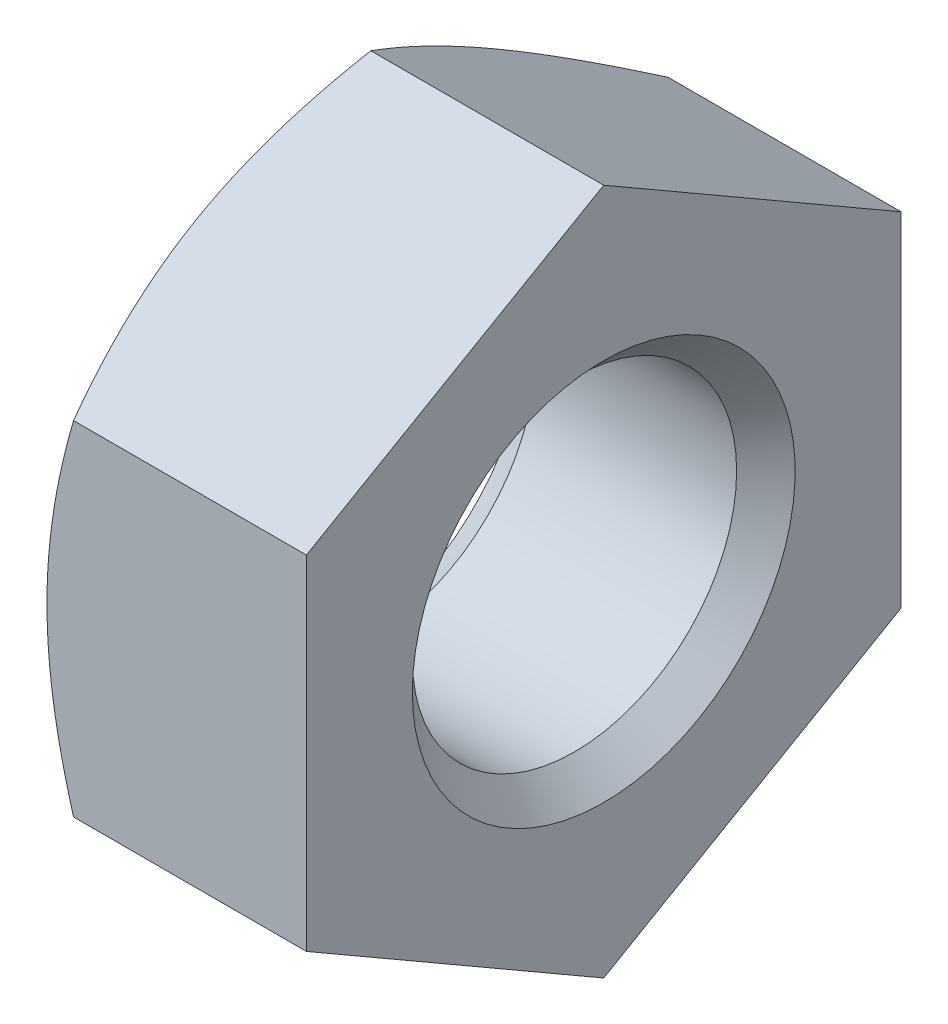
ISO-10303-21;
HEADER;
FILE_DESCRIPTION(('STEP AP214'),'2;1');
FILE_NAME('part.step','',(''),(''),'','','');
FILE_SCHEMA(('AUTOMOTIVE_DESIGN { 1 0 10303 214 1 1 1 1 }'));
ENDSEC;
DATA;
#1=APPLICATION_CONTEXT('core data for automotive mechanical design processes');
#2=APPLICATION_PROTOCOL_DEFINITION('international standard','automotive_design',2000,#1);
#3=PRODUCT_CONTEXT('',#1,'mechanical');
#4=PRODUCT('Part','Part','',(#3));
#5=PRODUCT_RELATED_PRODUCT_CATEGORY('part','',(#4));
#6=PRODUCT_DEFINITION_FORMATION('','',#4);
#7=PRODUCT_DEFINITION_CONTEXT('part definition',#1,'design');
#8=PRODUCT_DEFINITION('design','',#6,#7);
#9=PRODUCT_DEFINITION_SHAPE('','',#8);
#10=(LENGTH_UNIT() NAMED_UNIT(*) SI_UNIT(.MILLI.,.METRE.));
#11=(NAMED_UNIT(*) PLANE_ANGLE_UNIT() SI_UNIT($,.RADIAN.));
#12=(NAMED_UNIT(*) SI_UNIT($,.STERADIAN.) SOLID_ANGLE_UNIT());
#13=UNCERTAINTY_MEASURE_WITH_UNIT(LENGTH_MEASURE(1.E-05),#10,'distance_accuracy_value','');
#14=(GEOMETRIC_REPRESENTATION_CONTEXT(3) GLOBAL_UNCERTAINTY_ASSIGNED_CONTEXT((#13)) GLOBAL_UNIT_ASSIGNED_CONTEXT((#10,
#11,#12)) REPRESENTATION_CONTEXT('',''));
#15=CARTESIAN_POINT('',(0.,0.,0.));
#16=DIRECTION('',(0.,0.,1.));
#17=DIRECTION('',(1.,0.,0.));
#18=AXIS2_PLACEMENT_3D('',#15,#16,#17);
#19=CARTESIAN_POINT('',(-0.94019237886467,0.,0.));
#20=DIRECTION('',(1.,0.,0.));
#21=DIRECTION('',(0.,0.,-1.));
#22=AXIS2_PLACEMENT_3D('',#19,#20,#21);
#23=CONICAL_SURFACE('',#22,3.2,1.0471975511966);
#24=CARTESIAN_POINT('',(0.116899901263427,-4.2128176445144,-2.75));
#25=CARTESIAN_POINT('',(0.0585358150897928,-4.09206175441161,-2.75));
#26=CARTESIAN_POINT('',(0.000751313320708632,-3.97102058026674,-2.75));
#27=CARTESIAN_POINT('',(-0.11332737259427,-3.72821342104705,-2.75));
#28=CARTESIAN_POINT('',(-0.1696212991709,-3.60644731510048,-2.75));
#29=CARTESIAN_POINT('',(-0.280683816081055,-3.3613792497904,-2.75));
#30=CARTESIAN_POINT('',(-0.335441852528569,-3.23807249019038,-2.75));
#31=CARTESIAN_POINT('',(-0.442608769416106,-2.99044622504905,-2.75));
#32=CARTESIAN_POINT('',(-0.495017772139855,-2.86612677262461,-2.75));
#33=CARTESIAN_POINT('',(-0.597488011111556,-2.61472491435786,-2.75));
#34=CARTESIAN_POINT('',(-0.647512255717007,-2.48762734782283,-2.75));
#35=CARTESIAN_POINT('',(-0.743647769013464,-2.23193378863614,-2.75));
#36=CARTESIAN_POINT('',(-0.789758602600039,-2.10333763116981,-2.75));
#37=CARTESIAN_POINT('',(-0.876829746324347,-1.84470576670706,-2.75));
#38=CARTESIAN_POINT('',(-0.917800989357833,-1.71467377834625,-2.75));
#39=CARTESIAN_POINT('',(-0.993263613623143,-1.45276113270948,-2.75));
#40=CARTESIAN_POINT('',(-1.02775704200768,-1.32088107367671,-2.75));
#41=CARTESIAN_POINT('',(-1.08859053449044,-1.05518302145176,-2.75));
#42=CARTESIAN_POINT('',(-1.11492853241768,-0.921364546137669,-2.75));
#43=CARTESIAN_POINT('',(-1.15767953373874,-0.652112000043998,-2.75));
#44=CARTESIAN_POINT('',(-1.17409253050993,-0.51667792818645,-2.75));
#45=CARTESIAN_POINT('',(-1.19554160564382,-0.245762022708423,-2.75));
#46=CARTESIAN_POINT('',(-1.20064991451961,-0.110286056590175,-2.75));
#47=CARTESIAN_POINT('',(-1.1992173554919,0.160574270135581,-2.75));
#48=CARTESIAN_POINT('',(-1.19267952164877,0.295958645412523,-2.75));
#49=CARTESIAN_POINT('',(-1.17203672480029,0.527085181886233,-2.75));
#50=CARTESIAN_POINT('',(-1.16063339729711,0.623082191033736,-2.75));
#51=CARTESIAN_POINT('',(-1.13271188305182,0.81433598480462,-2.75));
#52=CARTESIAN_POINT('',(-1.1161928913043,0.909592650506843,-2.75));
#53=CARTESIAN_POINT('',(-1.059829209834,1.19417377130812,-2.75));
#54=CARTESIAN_POINT('',(-1.01319228175914,1.38216583216315,-2.75));
#55=CARTESIAN_POINT('',(-0.932739470552959,1.66347118298159,-2.75));
#56=CARTESIAN_POINT('',(-0.903761500041856,1.75825036010036,-2.75));
#57=CARTESIAN_POINT('',(-0.842933996229099,1.94681952572579,-2.75));
#58=CARTESIAN_POINT('',(-0.811086441961629,2.04061014688645,-2.75));
#59=CARTESIAN_POINT('',(-0.745182794916507,2.22681002484737,-2.75));
#60=CARTESIAN_POINT('',(-0.711140134891271,2.31922408448834,-2.75));
#61=CARTESIAN_POINT('',(-0.641053990054168,2.50333483778029,-2.75));
#62=CARTESIAN_POINT('',(-0.605009698237786,2.59503122483461,-2.75));
#63=CARTESIAN_POINT('',(-0.568162024521032,2.68639587514905,-2.75));
#64=B_SPLINE_CURVE_WITH_KNOTS('',3,(#24,#25,#26,#27,#28,#29,#30,#31,#32,#33,#34,#35,#36,#37,#38,
#39,#40,#41,#42,#43,#44,#45,#46,#47,#48,#49,#50,#51,#52,#53,#54,#55,#56,#57,#58,#59,#60,#61,#62,
#63),.UNSPECIFIED.,.F.,.F.,(4,2,2,2,2,2,2,2,2,2,2,2,2,2,2,2,2,2,2,4),(0.,0.402367371635709,
0.804803823938379,1.20953982216093,1.61425472649942,2.02396821262994,2.43372719238479,
2.8425991975322,3.2513417705758,3.6601878136146,4.06903412946197,4.47526051498547,
4.88138108563411,5.171255359401,5.46117527123616,6.0414458844777,6.33875257758383,
6.63585577731931,6.9312875346499,7.22683927936249),.UNSPECIFIED.);
#65=CARTESIAN_POINT('',(-1.2,0.,-2.75));
#66=VERTEX_POINT('',#65);
#67=CARTESIAN_POINT('',(-0.95437990693813,-1.5877132402715,-2.75));
#68=VERTEX_POINT('',#67);
#69=EDGE_CURVE('E208',#66,#68,#64,.F.);
#70=ORIENTED_EDGE('',*,*,#69,.T.);
#71=CARTESIAN_POINT('',(-0.954313236635232,-1.58759777021766,-2.7502));
#72=CARTESIAN_POINT('',(-0.99461233775073,-1.65737010029701,-2.62935077934009));
#73=CARTESIAN_POINT('',(-1.03126309740233,-1.72774469983536,-2.50745839737736));
#74=CARTESIAN_POINT('',(-1.0952378170302,-1.86971254687005,-2.2615628732721));
#75=CARTESIAN_POINT('',(-1.1225391443255,-1.94130831721585,-2.13755536142614));
#76=CARTESIAN_POINT('',(-1.16503825470588,-2.083612548896,-1.89107720202404));
#77=CARTESIAN_POINT('',(-1.18051888137754,-2.15429911309865,-1.76864448141257));
#78=CARTESIAN_POINT('',(-1.19900060263006,-2.29600490065924,-1.52320285763107));
#79=CARTESIAN_POINT('',(-1.2020170005374,-2.36702360884404,-1.40019484676707));
#80=CARTESIAN_POINT('',(-1.19574685457146,-2.49972966594897,-1.17034121338919));
#81=CARTESIAN_POINT('',(-1.1879998457233,-2.56143686540072,-1.06346120874596));
#82=CARTESIAN_POINT('',(-1.16344481893565,-2.68444923614045,-0.850397532665236));
#83=CARTESIAN_POINT('',(-1.14662841034944,-2.74575398185006,-0.744214598351098));
#84=CARTESIAN_POINT('',(-1.10458807765406,-2.86902004703204,-0.530711510606808));
#85=CARTESIAN_POINT('',(-1.07918591931279,-2.93096576264316,-0.423418383857138));
#86=CARTESIAN_POINT('',(-1.02153277416004,-3.0539332080613,-0.210432520715946));
#87=CARTESIAN_POINT('',(-0.98929533670104,-3.11495651365991,-0.104737054973346));
#88=CARTESIAN_POINT('',(-0.954313236635265,-3.17554195059674,0.000199999999999926));
#89=B_SPLINE_CURVE_WITH_KNOTS('',3,(#71,#72,#73,#74,#75,#76,#77,#78,#79,#80,#81,#82,#83,#84,#85,
#86,#87,#88),.UNSPECIFIED.,.F.,.F.,(4,2,2,2,2,2,2,2,4),(0.,0.43591282872589,0.872873557116336,
1.29901931904672,1.72464171213574,2.09526089052937,2.46622354066373,2.84541551798555,
3.22386274754521),.UNSPECIFIED.);
#90=CARTESIAN_POINT('',(-1.2,-2.38156986040723,-1.37499999999995));
#91=VERTEX_POINT('',#90);
#92=EDGE_CURVE('E11',#68,#91,#89,.T.);
#93=ORIENTED_EDGE('',*,*,#92,.T.);
#94=CARTESIAN_POINT('',(-1.2,0.,0.));
#95=DIRECTION('',(-1.,0.,0.));
#96=DIRECTION('',(0.,0.,1.));
#97=AXIS2_PLACEMENT_3D('',#94,#95,#96);
#98=CIRCLE('',#97,2.75);
#99=EDGE_CURVE('E254',#66,#91,#98,.T.);
#100=ORIENTED_EDGE('',*,*,#99,.F.);
#101=EDGE_LOOP('',(#70,#93,#100));
#102=FACE_BOUND('',#101,.T.);
#103=ADVANCED_FACE('F35',(#102),#23,.T.);
#104=CARTESIAN_POINT('',(-1.2,-2.38156986040723,1.37499999999995));
#105=VERTEX_POINT('',#104);
#106=EDGE_CURVE('E260',#91,#105,#98,.T.);
#107=ORIENTED_EDGE('',*,*,#106,.F.);
#108=CARTESIAN_POINT('',(-0.954379906938163,-3.1754264805429,0.));
#109=VERTEX_POINT('',#108);
#110=EDGE_CURVE('E39',#91,#109,#89,.T.);
#111=ORIENTED_EDGE('',*,*,#110,.T.);
#112=CARTESIAN_POINT('',(-0.954313236635265,-3.17554195059674,-0.00019999999999989));
#113=CARTESIAN_POINT('',(-0.99461233775076,-3.10576962051739,0.120649220659906));
#114=CARTESIAN_POINT('',(-1.03126309740236,-3.03539502097904,0.242541602622634));
#115=CARTESIAN_POINT('',(-1.09523781703022,-2.89342717394436,0.488437126727893));
#116=CARTESIAN_POINT('',(-1.12253914432552,-2.82183140359856,0.612444638573856));
#117=CARTESIAN_POINT('',(-1.16503825470589,-2.6795271719184,0.858922797975944));
#118=CARTESIAN_POINT('',(-1.18051888137755,-2.60884060771575,0.981355518587418));
#119=CARTESIAN_POINT('',(-1.19900060263007,-2.46713482015518,1.22679714236892));
#120=CARTESIAN_POINT('',(-1.2020170005374,-2.39611611197037,1.34980515323291));
#121=CARTESIAN_POINT('',(-1.19574685457145,-2.26341005486544,1.57965878661079));
#122=CARTESIAN_POINT('',(-1.1879998457233,-2.20170285541369,1.68653879125402));
#123=CARTESIAN_POINT('',(-1.16344481893564,-2.07869048467395,1.89960246733475));
#124=CARTESIAN_POINT('',(-1.14662841034943,-2.01738573896434,2.00578540164889));
#125=CARTESIAN_POINT('',(-1.10458807765404,-1.89411967378236,2.21928848939318));
#126=CARTESIAN_POINT('',(-1.07918591931276,-1.83217395817125,2.32658161614285));
#127=CARTESIAN_POINT('',(-1.02153277416001,-1.7092065127531,2.53956747928405));
#128=CARTESIAN_POINT('',(-0.98929533670101,-1.64818320715449,2.64526294502665));
#129=CARTESIAN_POINT('',(-0.954313236635232,-1.58759777021766,2.7502));
#130=B_SPLINE_CURVE_WITH_KNOTS('',3,(#112,#113,#114,#115,#116,#117,#118,#119,#120,#121,#122,
#123,#124,#125,#126,#127,#128,#129),.UNSPECIFIED.,.F.,.F.,(4,2,2,2,2,2,2,2,4),(0.,
0.435912828725883,0.87287355711632,1.2990193190467,1.72464171213571,2.09526089052935,
2.46622354066371,2.84541551798554,3.22386274754521),.UNSPECIFIED.);
#131=EDGE_CURVE('E217',#109,#105,#130,.T.);
#132=ORIENTED_EDGE('',*,*,#131,.T.);
#133=EDGE_LOOP('',(#107,#111,#132));
#134=FACE_BOUND('',#133,.T.);
#135=ADVANCED_FACE('F243',(#134),#23,.T.);
#136=CARTESIAN_POINT('',(-1.2,0.,2.75));
#137=VERTEX_POINT('',#136);
#138=EDGE_CURVE('E163',#105,#137,#98,.T.);
#139=ORIENTED_EDGE('',*,*,#138,.F.);
#140=CARTESIAN_POINT('',(-0.95437990693813,-1.5877132402715,2.75));
#141=VERTEX_POINT('',#140);
#142=EDGE_CURVE('E206',#105,#141,#130,.T.);
#143=ORIENTED_EDGE('',*,*,#142,.T.);
#144=CARTESIAN_POINT('',(0.116899901263427,-4.2128176445144,2.75));
#145=CARTESIAN_POINT('',(0.0585358150897928,-4.09206175441161,2.75));
#146=CARTESIAN_POINT('',(0.000751313320708632,-3.97102058026674,2.75));
#147=CARTESIAN_POINT('',(-0.11332737259427,-3.72821342104705,2.75));
#148=CARTESIAN_POINT('',(-0.1696212991709,-3.60644731510048,2.75));
#149=CARTESIAN_POINT('',(-0.280683816081055,-3.3613792497904,2.75));
#150=CARTESIAN_POINT('',(-0.335441852528569,-3.23807249019038,2.75));
#151=CARTESIAN_POINT('',(-0.442608769416106,-2.99044622504905,2.75));
#152=CARTESIAN_POINT('',(-0.495017772139855,-2.86612677262461,2.75));
#153=CARTESIAN_POINT('',(-0.597488011111556,-2.61472491435786,2.75));
#154=CARTESIAN_POINT('',(-0.647512255717007,-2.48762734782283,2.75));
#155=CARTESIAN_POINT('',(-0.743647769013464,-2.23193378863614,2.75));
#156=CARTESIAN_POINT('',(-0.789758602600039,-2.10333763116981,2.75));
#157=CARTESIAN_POINT('',(-0.876829746324347,-1.84470576670706,2.75));
#158=CARTESIAN_POINT('',(-0.917800989357833,-1.71467377834625,2.75));
#159=CARTESIAN_POINT('',(-0.993263613623143,-1.45276113270948,2.75));
#160=CARTESIAN_POINT('',(-1.02775704200768,-1.32088107367671,2.75));
#161=CARTESIAN_POINT('',(-1.08859053449044,-1.05518302145176,2.75));
#162=CARTESIAN_POINT('',(-1.11492853241768,-0.921364546137669,2.75));
#163=CARTESIAN_POINT('',(-1.15767953373874,-0.652112000043998,2.75));
#164=CARTESIAN_POINT('',(-1.17409253050993,-0.51667792818645,2.75));
#165=CARTESIAN_POINT('',(-1.19554160564382,-0.245762022708423,2.75));
#166=CARTESIAN_POINT('',(-1.20064991451961,-0.110286056590175,2.75));
#167=CARTESIAN_POINT('',(-1.1992173554919,0.160574270135581,2.75));
#168=CARTESIAN_POINT('',(-1.19267952164877,0.295958645412523,2.75));
#169=CARTESIAN_POINT('',(-1.17203672480029,0.527085181886233,2.75));
#170=CARTESIAN_POINT('',(-1.16063339729711,0.623082191033736,2.75));
#171=CARTESIAN_POINT('',(-1.13271188305182,0.81433598480462,2.75));
#172=CARTESIAN_POINT('',(-1.1161928913043,0.909592650506843,2.75));
#173=CARTESIAN_POINT('',(-1.059829209834,1.19417377130812,2.75));
#174=CARTESIAN_POINT('',(-1.01319228175914,1.38216583216315,2.75));
#175=CARTESIAN_POINT('',(-0.932739470552959,1.66347118298159,2.75));
#176=CARTESIAN_POINT('',(-0.903761500041856,1.75825036010036,2.75));
#177=CARTESIAN_POINT('',(-0.842933996229099,1.94681952572579,2.75));
#178=CARTESIAN_POINT('',(-0.811086441961629,2.04061014688645,2.75));
#179=CARTESIAN_POINT('',(-0.745182794916507,2.22681002484737,2.75));
#180=CARTESIAN_POINT('',(-0.711140134891271,2.31922408448834,2.75));
#181=CARTESIAN_POINT('',(-0.641053990054168,2.50333483778029,2.75));
#182=CARTESIAN_POINT('',(-0.605009698237786,2.59503122483461,2.75));
#183=CARTESIAN_POINT('',(-0.568162024521032,2.68639587514905,2.75));
#184=B_SPLINE_CURVE_WITH_KNOTS('',3,(#144,#145,#146,#147,#148,#149,#150,#151,#152,#153,#154,
#155,#156,#157,#158,#159,#160,#161,#162,#163,#164,#165,#166,#167,#168,#169,#170,#171,#172,#173,
#174,#175,#176,#177,#178,#179,#180,#181,#182,#183),.UNSPECIFIED.,.F.,.F.,(4,2,2,2,2,2,2,2,2,2,2,
2,2,2,2,2,2,2,2,4),(0.,0.402367371635709,0.804803823938379,1.20953982216093,1.61425472649942,
2.02396821262994,2.43372719238479,2.8425991975322,3.2513417705758,3.6601878136146,
4.06903412946197,4.47526051498547,4.88138108563411,5.171255359401,5.46117527123616,
6.0414458844777,6.33875257758383,6.63585577731931,6.9312875346499,7.22683927936249),.UNSPECIFIED.);
#185=EDGE_CURVE('E113',#141,#137,#184,.T.);
#186=ORIENTED_EDGE('',*,*,#185,.T.);
#187=EDGE_LOOP('',(#139,#143,#186));
#188=FACE_BOUND('',#187,.T.);
#189=ADVANCED_FACE('F248',(#188),#23,.T.);
#190=CARTESIAN_POINT('',(-0.954313236635265,3.17554195059674,0.00019999999999989));
#191=CARTESIAN_POINT('',(-0.99461233775076,3.10576962051739,-0.120649220659906));
#192=CARTESIAN_POINT('',(-1.03126309740236,3.03539502097904,-0.242541602622634));
#193=CARTESIAN_POINT('',(-1.09523781703022,2.89342717394436,-0.488437126727893));
#194=CARTESIAN_POINT('',(-1.12253914432552,2.82183140359856,-0.612444638573856));
#195=CARTESIAN_POINT('',(-1.16503825470589,2.6795271719184,-0.858922797975944));
#196=CARTESIAN_POINT('',(-1.18051888137755,2.60884060771575,-0.981355518587418));
#197=CARTESIAN_POINT('',(-1.19900060263007,2.46713482015518,-1.22679714236892));
#198=CARTESIAN_POINT('',(-1.2020170005374,2.39611611197037,-1.34980515323291));
#199=CARTESIAN_POINT('',(-1.19574685457145,2.26341005486544,-1.57965878661079));
#200=CARTESIAN_POINT('',(-1.1879998457233,2.20170285541369,-1.68653879125402));
#201=CARTESIAN_POINT('',(-1.16344481893564,2.07869048467395,-1.89960246733475));
#202=CARTESIAN_POINT('',(-1.14662841034943,2.01738573896434,-2.00578540164889));
#203=CARTESIAN_POINT('',(-1.10458807765404,1.89411967378236,-2.21928848939318));
#204=CARTESIAN_POINT('',(-1.07918591931276,1.83217395817125,-2.32658161614285));
#205=CARTESIAN_POINT('',(-1.02153277416001,1.7092065127531,-2.53956747928405));
#206=CARTESIAN_POINT('',(-0.98929533670101,1.64818320715449,-2.64526294502665));
#207=CARTESIAN_POINT('',(-0.954313236635232,1.58759777021766,-2.7502));
#208=B_SPLINE_CURVE_WITH_KNOTS('',3,(#190,#191,#192,#193,#194,#195,#196,#197,#198,#199,#200,
#201,#202,#203,#204,#205,#206,#207),.UNSPECIFIED.,.F.,.F.,(4,2,2,2,2,2,2,2,4),(0.,
0.435912828725883,0.87287355711632,1.2990193190467,1.72464171213571,2.09526089052935,
2.46622354066371,2.84541551798554,3.22386274754521),.UNSPECIFIED.);
#209=CARTESIAN_POINT('',(-1.2,2.38156986040723,-1.37499999999995));
#210=VERTEX_POINT('',#209);
#211=CARTESIAN_POINT('',(-0.95437990693813,1.5877132402715,-2.75));
#212=VERTEX_POINT('',#211);
#213=EDGE_CURVE('E207',#210,#212,#208,.T.);
#214=ORIENTED_EDGE('',*,*,#213,.T.);
#215=EDGE_CURVE('E201',#212,#66,#64,.F.);
#216=ORIENTED_EDGE('',*,*,#215,.T.);
#217=EDGE_CURVE('E265',#210,#66,#98,.T.);
#218=ORIENTED_EDGE('',*,*,#217,.F.);
#219=EDGE_LOOP('',(#214,#216,#218));
#220=FACE_BOUND('',#219,.T.);
#221=ADVANCED_FACE('F272',(#220),#23,.T.);
#222=CARTESIAN_POINT('',(-1.2,2.38156986040723,1.37499999999995));
#223=VERTEX_POINT('',#222);
#224=EDGE_CURVE('E164',#137,#223,#98,.T.);
#225=ORIENTED_EDGE('',*,*,#224,.F.);
#226=CARTESIAN_POINT('',(-0.95437990693813,1.5877132402715,2.75));
#227=VERTEX_POINT('',#226);
#228=EDGE_CURVE('E209',#137,#227,#184,.T.);
#229=ORIENTED_EDGE('',*,*,#228,.T.);
#230=CARTESIAN_POINT('',(-0.954313236635232,1.58759777021766,2.7502));
#231=CARTESIAN_POINT('',(-0.99461233775073,1.65737010029701,2.62935077934009));
#232=CARTESIAN_POINT('',(-1.03126309740233,1.72774469983536,2.50745839737736));
#233=CARTESIAN_POINT('',(-1.0952378170302,1.86971254687005,2.2615628732721));
#234=CARTESIAN_POINT('',(-1.1225391443255,1.94130831721585,2.13755536142614));
#235=CARTESIAN_POINT('',(-1.16503825470588,2.083612548896,1.89107720202404));
#236=CARTESIAN_POINT('',(-1.18051888137754,2.15429911309865,1.76864448141257));
#237=CARTESIAN_POINT('',(-1.19900060263006,2.29600490065924,1.52320285763107));
#238=CARTESIAN_POINT('',(-1.2020170005374,2.36702360884404,1.40019484676707));
#239=CARTESIAN_POINT('',(-1.19574685457146,2.49972966594897,1.17034121338919));
#240=CARTESIAN_POINT('',(-1.1879998457233,2.56143686540072,1.06346120874596));
#241=CARTESIAN_POINT('',(-1.16344481893565,2.68444923614045,0.850397532665236));
#242=CARTESIAN_POINT('',(-1.14662841034944,2.74575398185006,0.744214598351098));
#243=CARTESIAN_POINT('',(-1.10458807765406,2.86902004703204,0.530711510606808));
#244=CARTESIAN_POINT('',(-1.07918591931279,2.93096576264316,0.423418383857138));
#245=CARTESIAN_POINT('',(-1.02153277416004,3.0539332080613,0.210432520715946));
#246=CARTESIAN_POINT('',(-0.98929533670104,3.11495651365991,0.104737054973346));
#247=CARTESIAN_POINT('',(-0.954313236635265,3.17554195059674,-0.000199999999999926));
#248=B_SPLINE_CURVE_WITH_KNOTS('',3,(#230,#231,#232,#233,#234,#235,#236,#237,#238,#239,#240,
#241,#242,#243,#244,#245,#246,#247),.UNSPECIFIED.,.F.,.F.,(4,2,2,2,2,2,2,2,4),(0.,
0.43591282872589,0.872873557116336,1.29901931904672,1.72464171213574,2.09526089052937,
2.46622354066373,2.84541551798555,3.22386274754521),.UNSPECIFIED.);
#249=EDGE_CURVE('E175',#227,#223,#248,.T.);
#250=ORIENTED_EDGE('',*,*,#249,.T.);
#251=EDGE_LOOP('',(#225,#229,#250));
#252=FACE_BOUND('',#251,.T.);
#253=ADVANCED_FACE('F240',(#252),#23,.T.);
#254=CARTESIAN_POINT('',(-1.2,0.,0.));
#255=DIRECTION('',(1.,0.,0.));
#256=DIRECTION('',(0.,0.,-1.));
#257=AXIS2_PLACEMENT_3D('',#254,#255,#256);
#258=PLANE('',#257);
#259=ORIENTED_EDGE('',*,*,#224,.T.);
#260=EDGE_CURVE('E168',#223,#210,#98,.T.);
#261=ORIENTED_EDGE('',*,*,#260,.T.);
#262=ORIENTED_EDGE('',*,*,#217,.T.);
#263=ORIENTED_EDGE('',*,*,#99,.T.);
#264=ORIENTED_EDGE('',*,*,#106,.T.);
#265=ORIENTED_EDGE('',*,*,#138,.T.);
#266=EDGE_LOOP('',(#259,#261,#262,#263,#264,#265));
#267=FACE_BOUND('',#266,.T.);
#268=CARTESIAN_POINT('',(-1.2,0.,0.));
#269=DIRECTION('',(-1.,0.,0.));
#270=DIRECTION('',(0.,0.,1.));
#271=AXIS2_PLACEMENT_3D('',#268,#269,#270);
#272=CIRCLE('',#271,1.7);
#273=CARTESIAN_POINT('',(-1.2,0.,1.7));
#274=VERTEX_POINT('',#273);
#275=EDGE_CURVE('E160',#274,#274,#272,.T.);
#276=ORIENTED_EDGE('',*,*,#275,.F.);
#277=EDGE_LOOP('',(#276));
#278=FACE_BOUND('',#277,.T.);
#279=ADVANCED_FACE('F37',(#267,#278),#258,.F.);
#280=CARTESIAN_POINT('',(1.2,3.2,0.));
#281=DIRECTION('',(-1.,0.,0.));
#282=DIRECTION('',(0.,0.,1.));
#283=AXIS2_PLACEMENT_3D('',#280,#281,#282);
#284=PLANE('',#283);
#285=DIRECTION('',(0.,-0.499999999999983,0.866025403784448));
#286=VECTOR('',#285,1.);
#287=CARTESIAN_POINT('',(1.2,3.1754264805429,0.));
#288=LINE('',#287,#286);
#289=CARTESIAN_POINT('',(1.2,3.1754264805429,0.));
#290=VERTEX_POINT('',#289);
#291=CARTESIAN_POINT('',(1.2,1.5877132402715,2.75));
#292=VERTEX_POINT('',#291);
#293=EDGE_CURVE('E132',#290,#292,#288,.T.);
#294=ORIENTED_EDGE('',*,*,#293,.T.);
#295=DIRECTION('',(0.,-1.,0.));
#296=VECTOR('',#295,1.);
#297=CARTESIAN_POINT('',(1.2,1.5877132402715,2.75));
#298=LINE('',#297,#296);
#299=CARTESIAN_POINT('',(1.2,-1.5877132402715,2.75));
#300=VERTEX_POINT('',#299);
#301=EDGE_CURVE('E54',#292,#300,#298,.T.);
#302=ORIENTED_EDGE('',*,*,#301,.T.);
#303=DIRECTION('',(0.,-0.499999999999983,-0.866025403784448));
#304=VECTOR('',#303,1.);
#305=CARTESIAN_POINT('',(1.2,-1.5877132402715,2.75));
#306=LINE('',#305,#304);
#307=CARTESIAN_POINT('',(1.2,-3.1754264805429,0.));
#308=VERTEX_POINT('',#307);
#309=EDGE_CURVE('E120',#300,#308,#306,.T.);
#310=ORIENTED_EDGE('',*,*,#309,.T.);
#311=DIRECTION('',(0.,0.499999999999983,-0.866025403784448));
#312=VECTOR('',#311,1.);
#313=CARTESIAN_POINT('',(1.2,-3.1754264805429,0.));
#314=LINE('',#313,#312);
#315=CARTESIAN_POINT('',(1.2,-1.5877132402715,-2.75));
#316=VERTEX_POINT('',#315);
#317=EDGE_CURVE('E126',#308,#316,#314,.T.);
#318=ORIENTED_EDGE('',*,*,#317,.T.);
#319=DIRECTION('',(0.,1.,0.));
#320=VECTOR('',#319,1.);
#321=CARTESIAN_POINT('',(1.2,-1.5877132402715,-2.75));
#322=LINE('',#321,#320);
#323=CARTESIAN_POINT('',(1.2,1.5877132402715,-2.75));
#324=VERTEX_POINT('',#323);
#325=EDGE_CURVE('E136',#316,#324,#322,.T.);
#326=ORIENTED_EDGE('',*,*,#325,.T.);
#327=DIRECTION('',(0.,0.499999999999983,0.866025403784448));
#328=VECTOR('',#327,1.);
#329=CARTESIAN_POINT('',(1.2,1.5877132402715,-2.75));
#330=LINE('',#329,#328);
#331=EDGE_CURVE('E139',#324,#290,#330,.T.);
#332=ORIENTED_EDGE('',*,*,#331,.T.);
#333=EDGE_LOOP('',(#294,#302,#310,#318,#326,#332));
#334=FACE_BOUND('',#333,.T.);
#335=CARTESIAN_POINT('',(1.2,0.,0.));
#336=DIRECTION('',(-1.,0.,0.));
#337=DIRECTION('',(0.,0.,1.));
#338=AXIS2_PLACEMENT_3D('',#335,#336,#337);
#339=CIRCLE('',#338,1.7705);
#340=CARTESIAN_POINT('',(1.2,0.,1.7705));
#341=VERTEX_POINT('',#340);
#342=EDGE_CURVE('E116',#341,#341,#339,.T.);
#343=ORIENTED_EDGE('',*,*,#342,.T.);
#344=EDGE_LOOP('',(#343));
#345=FACE_BOUND('',#344,.T.);
#346=ADVANCED_FACE('F129',(#334,#345),#284,.F.);
#347=CARTESIAN_POINT('',(-0.954379906938163,3.1754264805429,0.));
#348=VERTEX_POINT('',#347);
#349=EDGE_CURVE('E167',#223,#348,#248,.T.);
#350=ORIENTED_EDGE('',*,*,#349,.T.);
#351=EDGE_CURVE('E176',#348,#210,#208,.T.);
#352=ORIENTED_EDGE('',*,*,#351,.T.);
#353=ORIENTED_EDGE('',*,*,#260,.F.);
#354=EDGE_LOOP('',(#350,#352,#353));
#355=FACE_BOUND('',#354,.T.);
#356=ADVANCED_FACE('F182',(#355),#23,.T.);
#357=CARTESIAN_POINT('',(-0.9295,0.,0.));
#358=DIRECTION('',(-1.,0.,0.));
#359=DIRECTION('',(0.,0.,1.));
#360=AXIS2_PLACEMENT_3D('',#357,#358,#359);
#361=CONICAL_SURFACE('',#360,1.5,0.636664116633749);
#362=ORIENTED_EDGE('',*,*,#275,.T.);
#363=EDGE_LOOP('',(#362));
#364=FACE_BOUND('',#363,.T.);
#365=CARTESIAN_POINT('',(-0.9295,0.,0.));
#366=DIRECTION('',(-1.,0.,0.));
#367=DIRECTION('',(0.,0.,1.));
#368=AXIS2_PLACEMENT_3D('',#365,#366,#367);
#369=CIRCLE('',#368,1.5);
#370=CARTESIAN_POINT('',(-0.9295,0.,1.5));
#371=VERTEX_POINT('',#370);
#372=EDGE_CURVE('E157',#371,#371,#369,.T.);
#373=ORIENTED_EDGE('',*,*,#372,.F.);
#374=EDGE_LOOP('',(#373));
#375=FACE_BOUND('',#374,.T.);
#376=ADVANCED_FACE('F230',(#364,#375),#361,.F.);
#377=CARTESIAN_POINT('',(1.2,0.,0.));
#378=DIRECTION('',(-1.,0.,0.));
#379=DIRECTION('',(0.,0.,1.));
#380=AXIS2_PLACEMENT_3D('',#377,#378,#379);
#381=CYLINDRICAL_SURFACE('',#380,1.5);
#382=ORIENTED_EDGE('',*,*,#372,.T.);
#383=EDGE_LOOP('',(#382));
#384=FACE_BOUND('',#383,.T.);
#385=CARTESIAN_POINT('',(0.9295,0.,0.));
#386=DIRECTION('',(-1.,0.,0.));
#387=DIRECTION('',(0.,0.,1.));
#388=AXIS2_PLACEMENT_3D('',#385,#386,#387);
#389=CIRCLE('',#388,1.5);
#390=CARTESIAN_POINT('',(0.9295,0.,1.5));
#391=VERTEX_POINT('',#390);
#392=EDGE_CURVE('E154',#391,#391,#389,.T.);
#393=ORIENTED_EDGE('',*,*,#392,.F.);
#394=EDGE_LOOP('',(#393));
#395=FACE_BOUND('',#394,.T.);
#396=ADVANCED_FACE('F226',(#384,#395),#381,.F.);
#397=CARTESIAN_POINT('',(1.2,0.,0.));
#398=DIRECTION('',(1.,0.,0.));
#399=DIRECTION('',(0.,0.,-1.));
#400=AXIS2_PLACEMENT_3D('',#397,#398,#399);
#401=CONICAL_SURFACE('',#400,1.7705,0.785398163397448);
#402=ORIENTED_EDGE('',*,*,#392,.T.);
#403=EDGE_LOOP('',(#402));
#404=FACE_BOUND('',#403,.T.);
#405=ORIENTED_EDGE('',*,*,#342,.F.);
#406=EDGE_LOOP('',(#405));
#407=FACE_BOUND('',#406,.T.);
#408=ADVANCED_FACE('F223',(#404,#407),#401,.F.);
#409=CARTESIAN_POINT('',(1.2,1.5877132402715,2.75));
#410=DIRECTION('',(0.,0.,-1.));
#411=DIRECTION('',(-1.,0.,0.));
#412=AXIS2_PLACEMENT_3D('',#409,#410,#411);
#413=PLANE('',#412);
#414=DIRECTION('',(-1.,0.,0.));
#415=VECTOR('',#414,1.);
#416=CARTESIAN_POINT('',(1.2,-1.5877132402715,2.75));
#417=LINE('',#416,#415);
#418=EDGE_CURVE('E109',#300,#141,#417,.T.);
#419=ORIENTED_EDGE('',*,*,#418,.F.);
#420=ORIENTED_EDGE('',*,*,#301,.F.);
#421=DIRECTION('',(-1.,0.,0.));
#422=VECTOR('',#421,1.);
#423=CARTESIAN_POINT('',(1.2,1.5877132402715,2.75));
#424=LINE('',#423,#422);
#425=EDGE_CURVE('E142',#292,#227,#424,.T.);
#426=ORIENTED_EDGE('',*,*,#425,.T.);
#427=ORIENTED_EDGE('',*,*,#228,.F.);
#428=ORIENTED_EDGE('',*,*,#185,.F.);
#429=EDGE_LOOP('',(#419,#420,#426,#427,#428));
#430=FACE_BOUND('',#429,.T.);
#431=ADVANCED_FACE('F111',(#430),#413,.F.);
#432=CARTESIAN_POINT('',(1.2,-1.5877132402715,2.75));
#433=DIRECTION('',(0.,0.866025403784448,-0.499999999999983));
#434=DIRECTION('',(0.,0.499999999999983,0.866025403784448));
#435=AXIS2_PLACEMENT_3D('',#432,#433,#434);
#436=PLANE('',#435);
#437=DIRECTION('',(-1.,0.,0.));
#438=VECTOR('',#437,1.);
#439=CARTESIAN_POINT('',(1.2,-3.1754264805429,0.));
#440=LINE('',#439,#438);
#441=EDGE_CURVE('E117',#308,#109,#440,.T.);
#442=ORIENTED_EDGE('',*,*,#441,.F.);
#443=ORIENTED_EDGE('',*,*,#309,.F.);
#444=ORIENTED_EDGE('',*,*,#418,.T.);
#445=ORIENTED_EDGE('',*,*,#142,.F.);
#446=ORIENTED_EDGE('',*,*,#131,.F.);
#447=EDGE_LOOP('',(#442,#443,#444,#445,#446));
#448=FACE_BOUND('',#447,.T.);
#449=ADVANCED_FACE('F121',(#448),#436,.F.);
#450=CARTESIAN_POINT('',(1.2,-3.1754264805429,0.));
#451=DIRECTION('',(0.,0.866025403784448,0.499999999999983));
#452=DIRECTION('',(0.,-0.499999999999983,0.866025403784448));
#453=AXIS2_PLACEMENT_3D('',#450,#451,#452);
#454=PLANE('',#453);
#455=DIRECTION('',(-1.,0.,0.));
#456=VECTOR('',#455,1.);
#457=CARTESIAN_POINT('',(1.2,-1.5877132402715,-2.75));
#458=LINE('',#457,#456);
#459=EDGE_CURVE('E148',#316,#68,#458,.T.);
#460=ORIENTED_EDGE('',*,*,#459,.F.);
#461=ORIENTED_EDGE('',*,*,#317,.F.);
#462=ORIENTED_EDGE('',*,*,#441,.T.);
#463=ORIENTED_EDGE('',*,*,#110,.F.);
#464=ORIENTED_EDGE('',*,*,#92,.F.);
#465=EDGE_LOOP('',(#460,#461,#462,#463,#464));
#466=FACE_BOUND('',#465,.T.);
#467=ADVANCED_FACE('F196',(#466),#454,.F.);
#468=CARTESIAN_POINT('',(1.2,-1.5877132402715,-2.75));
#469=DIRECTION('',(0.,0.,1.));
#470=DIRECTION('',(1.,0.,0.));
#471=AXIS2_PLACEMENT_3D('',#468,#469,#470);
#472=PLANE('',#471);
#473=DIRECTION('',(-1.,0.,0.));
#474=VECTOR('',#473,1.);
#475=CARTESIAN_POINT('',(1.2,1.5877132402715,-2.75));
#476=LINE('',#475,#474);
#477=EDGE_CURVE('E145',#324,#212,#476,.T.);
#478=ORIENTED_EDGE('',*,*,#477,.F.);
#479=ORIENTED_EDGE('',*,*,#325,.F.);
#480=ORIENTED_EDGE('',*,*,#459,.T.);
#481=ORIENTED_EDGE('',*,*,#69,.F.);
#482=ORIENTED_EDGE('',*,*,#215,.F.);
#483=EDGE_LOOP('',(#478,#479,#480,#481,#482));
#484=FACE_BOUND('',#483,.T.);
#485=ADVANCED_FACE('F192',(#484),#472,.F.);
#486=CARTESIAN_POINT('',(1.2,1.5877132402715,-2.75));
#487=DIRECTION('',(0.,-0.866025403784448,0.499999999999983));
#488=DIRECTION('',(0.,-0.499999999999983,-0.866025403784448));
#489=AXIS2_PLACEMENT_3D('',#486,#487,#488);
#490=PLANE('',#489);
#491=DIRECTION('',(-1.,0.,0.));
#492=VECTOR('',#491,1.);
#493=CARTESIAN_POINT('',(1.2,3.1754264805429,0.));
#494=LINE('',#493,#492);
#495=EDGE_CURVE('E62',#290,#348,#494,.T.);
#496=ORIENTED_EDGE('',*,*,#495,.F.);
#497=ORIENTED_EDGE('',*,*,#331,.F.);
#498=ORIENTED_EDGE('',*,*,#477,.T.);
#499=ORIENTED_EDGE('',*,*,#213,.F.);
#500=ORIENTED_EDGE('',*,*,#351,.F.);
#501=EDGE_LOOP('',(#496,#497,#498,#499,#500));
#502=FACE_BOUND('',#501,.T.);
#503=ADVANCED_FACE('F188',(#502),#490,.F.);
#504=CARTESIAN_POINT('',(1.2,3.1754264805429,0.));
#505=DIRECTION('',(0.,-0.866025403784448,-0.499999999999983));
#506=DIRECTION('',(0.,0.499999999999983,-0.866025403784448));
#507=AXIS2_PLACEMENT_3D('',#504,#505,#506);
#508=PLANE('',#507);
#509=ORIENTED_EDGE('',*,*,#425,.F.);
#510=ORIENTED_EDGE('',*,*,#293,.F.);
#511=ORIENTED_EDGE('',*,*,#495,.T.);
#512=ORIENTED_EDGE('',*,*,#349,.F.);
#513=ORIENTED_EDGE('',*,*,#249,.F.);
#514=EDGE_LOOP('',(#509,#510,#511,#512,#513));
#515=FACE_BOUND('',#514,.T.);
#516=ADVANCED_FACE('F185',(#515),#508,.F.);
#517=CLOSED_SHELL('',(#103,#135,#189,#221,#253,#279,#346,#356,#376,#396,#408,#431,#449,#467,
#485,#503,#516));
#518=MANIFOLD_SOLID_BREP('B2',#517);
#519=ADVANCED_BREP_SHAPE_REPRESENTATION('',(#18,#518),#14);
#520=SHAPE_DEFINITION_REPRESENTATION(#9,#519);
ENDSEC;
END-ISO-10303-21;
